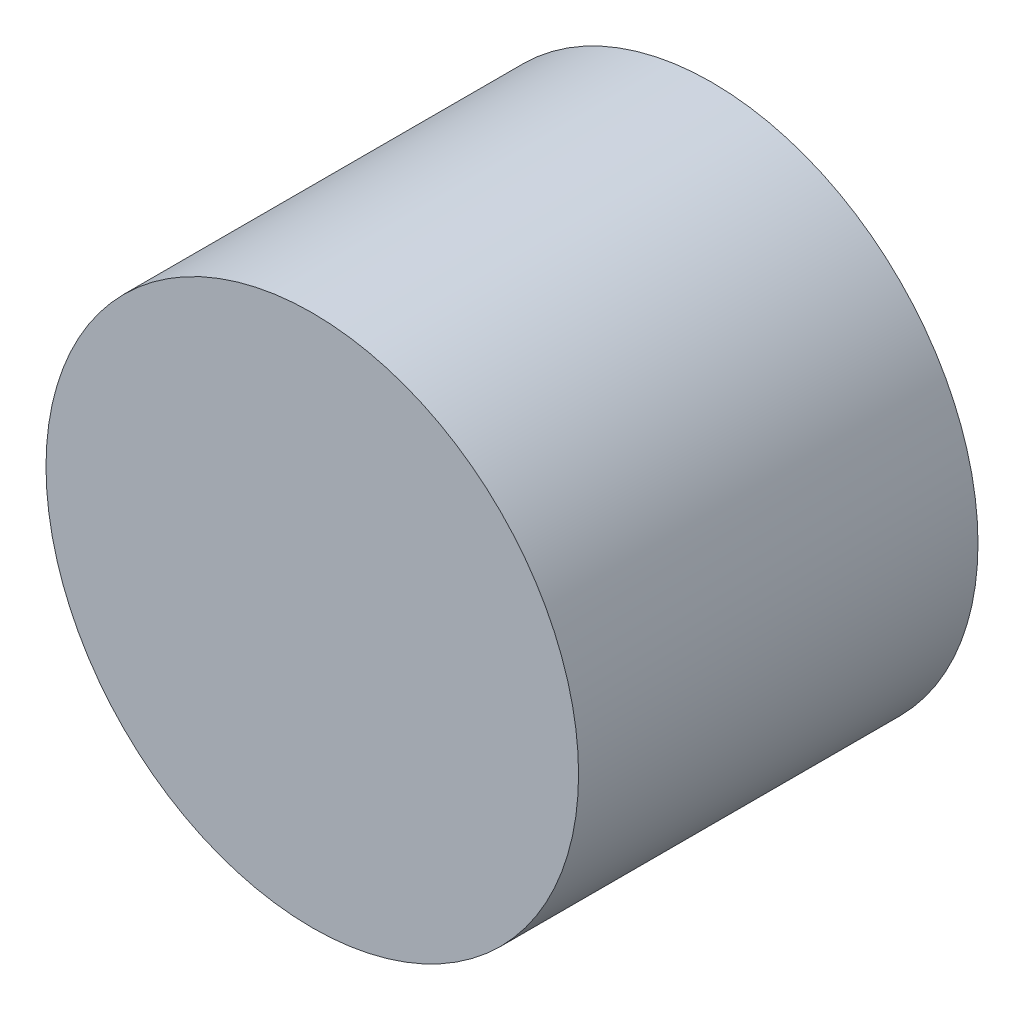
ISO-10303-21;
HEADER;
FILE_DESCRIPTION(('STEP AP214'),'2;1');
FILE_NAME('part.step','',(''),(''),'','','');
FILE_SCHEMA(('AUTOMOTIVE_DESIGN { 1 0 10303 214 1 1 1 1 }'));
ENDSEC;
DATA;
#1=APPLICATION_CONTEXT('core data for automotive mechanical design processes');
#2=APPLICATION_PROTOCOL_DEFINITION('international standard','automotive_design',2000,#1);
#3=PRODUCT_CONTEXT('',#1,'mechanical');
#4=PRODUCT('Part','Part','',(#3));
#5=PRODUCT_RELATED_PRODUCT_CATEGORY('part','',(#4));
#6=PRODUCT_DEFINITION_FORMATION('','',#4);
#7=PRODUCT_DEFINITION_CONTEXT('part definition',#1,'design');
#8=PRODUCT_DEFINITION('design','',#6,#7);
#9=PRODUCT_DEFINITION_SHAPE('','',#8);
#10=(LENGTH_UNIT() NAMED_UNIT(*) SI_UNIT(.MILLI.,.METRE.));
#11=(NAMED_UNIT(*) PLANE_ANGLE_UNIT() SI_UNIT($,.RADIAN.));
#12=(NAMED_UNIT(*) SI_UNIT($,.STERADIAN.) SOLID_ANGLE_UNIT());
#13=UNCERTAINTY_MEASURE_WITH_UNIT(LENGTH_MEASURE(1.E-05),#10,'distance_accuracy_value','');
#14=(GEOMETRIC_REPRESENTATION_CONTEXT(3) GLOBAL_UNCERTAINTY_ASSIGNED_CONTEXT((#13)) GLOBAL_UNIT_ASSIGNED_CONTEXT((#10,
#11,#12)) REPRESENTATION_CONTEXT('',''));
#15=CARTESIAN_POINT('',(0.,0.,0.));
#16=DIRECTION('',(0.,0.,1.));
#17=DIRECTION('',(1.,0.,0.));
#18=AXIS2_PLACEMENT_3D('',#15,#16,#17);
#19=CARTESIAN_POINT('',(0.,0.,9.));
#20=DIRECTION('',(0.,0.,-1.));
#21=DIRECTION('',(-1.,0.,0.));
#22=AXIS2_PLACEMENT_3D('',#19,#20,#21);
#23=CYLINDRICAL_SURFACE('',#22,6.);
#24=CARTESIAN_POINT('',(0.,0.,9.));
#25=DIRECTION('',(0.,0.,1.));
#26=DIRECTION('',(1.,0.,0.));
#27=AXIS2_PLACEMENT_3D('',#24,#25,#26);
#28=CIRCLE('',#27,6.);
#29=CARTESIAN_POINT('',(6.,0.,9.));
#30=VERTEX_POINT('',#29);
#31=EDGE_CURVE('E10',#30,#30,#28,.T.);
#32=ORIENTED_EDGE('',*,*,#31,.F.);
#33=EDGE_LOOP('',(#32));
#34=FACE_BOUND('',#33,.T.);
#35=CARTESIAN_POINT('',(0.,0.,0.));
#36=DIRECTION('',(0.,0.,1.));
#37=DIRECTION('',(1.,0.,0.));
#38=AXIS2_PLACEMENT_3D('',#35,#36,#37);
#39=CIRCLE('',#38,6.);
#40=CARTESIAN_POINT('',(6.,0.,0.));
#41=VERTEX_POINT('',#40);
#42=EDGE_CURVE('E34',#41,#41,#39,.T.);
#43=ORIENTED_EDGE('',*,*,#42,.T.);
#44=EDGE_LOOP('',(#43));
#45=FACE_BOUND('',#44,.T.);
#46=ADVANCED_FACE('F31',(#34,#45),#23,.T.);
#47=CARTESIAN_POINT('',(0.,0.,9.));
#48=DIRECTION('',(0.,0.,1.));
#49=DIRECTION('',(1.,0.,0.));
#50=AXIS2_PLACEMENT_3D('',#47,#48,#49);
#51=PLANE('',#50);
#52=ORIENTED_EDGE('',*,*,#31,.T.);
#53=EDGE_LOOP('',(#52));
#54=FACE_BOUND('',#53,.T.);
#55=ADVANCED_FACE('F46',(#54),#51,.T.);
#56=CARTESIAN_POINT('',(0.,0.,0.));
#57=DIRECTION('',(0.,0.,1.));
#58=DIRECTION('',(1.,0.,0.));
#59=AXIS2_PLACEMENT_3D('',#56,#57,#58);
#60=PLANE('',#59);
#61=ORIENTED_EDGE('',*,*,#42,.F.);
#62=EDGE_LOOP('',(#61));
#63=FACE_BOUND('',#62,.T.);
#64=ADVANCED_FACE('F44',(#63),#60,.F.);
#65=CLOSED_SHELL('',(#46,#55,#64));
#66=MANIFOLD_SOLID_BREP('B2',#65);
#67=ADVANCED_BREP_SHAPE_REPRESENTATION('',(#18,#66),#14);
#68=SHAPE_DEFINITION_REPRESENTATION(#9,#67);
ENDSEC;
END-ISO-10303-21;
